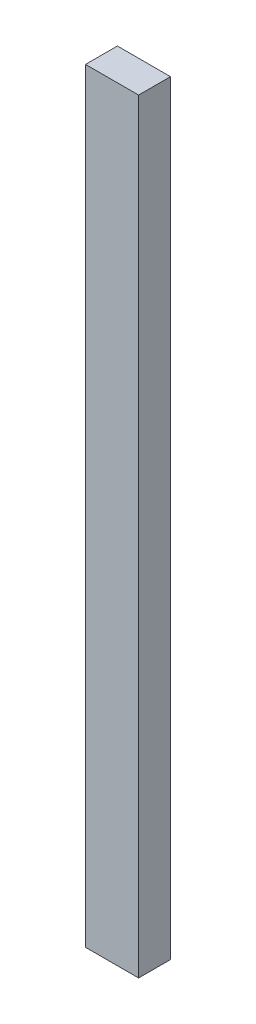
ISO-10303-21;
HEADER;
FILE_DESCRIPTION(('STEP AP214'),'2;1');
FILE_NAME('part.step','',(''),(''),'','','');
FILE_SCHEMA(('AUTOMOTIVE_DESIGN { 1 0 10303 214 1 1 1 1 }'));
ENDSEC;
DATA;
#1=APPLICATION_CONTEXT('core data for automotive mechanical design processes');
#2=APPLICATION_PROTOCOL_DEFINITION('international standard','automotive_design',2000,#1);
#3=PRODUCT_CONTEXT('',#1,'mechanical');
#4=PRODUCT('Part','Part','',(#3));
#5=PRODUCT_RELATED_PRODUCT_CATEGORY('part','',(#4));
#6=PRODUCT_DEFINITION_FORMATION('','',#4);
#7=PRODUCT_DEFINITION_CONTEXT('part definition',#1,'design');
#8=PRODUCT_DEFINITION('design','',#6,#7);
#9=PRODUCT_DEFINITION_SHAPE('','',#8);
#10=(LENGTH_UNIT() NAMED_UNIT(*) SI_UNIT(.MILLI.,.METRE.));
#11=(NAMED_UNIT(*) PLANE_ANGLE_UNIT() SI_UNIT($,.RADIAN.));
#12=(NAMED_UNIT(*) SI_UNIT($,.STERADIAN.) SOLID_ANGLE_UNIT());
#13=UNCERTAINTY_MEASURE_WITH_UNIT(LENGTH_MEASURE(1.E-05),#10,'distance_accuracy_value','');
#14=(GEOMETRIC_REPRESENTATION_CONTEXT(3) GLOBAL_UNCERTAINTY_ASSIGNED_CONTEXT((#13)) GLOBAL_UNIT_ASSIGNED_CONTEXT((#10,
#11,#12)) REPRESENTATION_CONTEXT('',''));
#15=CARTESIAN_POINT('',(0.,0.,0.));
#16=DIRECTION('',(0.,0.,1.));
#17=DIRECTION('',(1.,0.,0.));
#18=AXIS2_PLACEMENT_3D('',#15,#16,#17);
#19=CARTESIAN_POINT('',(31.75,914.4,19.05));
#20=DIRECTION('',(-1.,0.,0.));
#21=DIRECTION('',(0.,0.,1.));
#22=AXIS2_PLACEMENT_3D('',#19,#20,#21);
#23=PLANE('',#22);
#24=DIRECTION('',(0.,0.,-1.));
#25=VECTOR('',#24,1.);
#26=CARTESIAN_POINT('',(31.75,0.,19.05));
#27=LINE('',#26,#25);
#28=CARTESIAN_POINT('',(31.75,0.,19.05));
#29=VERTEX_POINT('',#28);
#30=CARTESIAN_POINT('',(31.75,0.,-19.05));
#31=VERTEX_POINT('',#30);
#32=EDGE_CURVE('E98',#29,#31,#27,.T.);
#33=ORIENTED_EDGE('',*,*,#32,.T.);
#34=DIRECTION('',(0.,-1.,0.));
#35=VECTOR('',#34,1.);
#36=CARTESIAN_POINT('',(31.75,914.4,-19.05));
#37=LINE('',#36,#35);
#38=CARTESIAN_POINT('',(31.75,914.4,-19.05));
#39=VERTEX_POINT('',#38);
#40=EDGE_CURVE('E11',#39,#31,#37,.T.);
#41=ORIENTED_EDGE('',*,*,#40,.F.);
#42=DIRECTION('',(0.,0.,-1.));
#43=VECTOR('',#42,1.);
#44=CARTESIAN_POINT('',(31.75,914.4,19.05));
#45=LINE('',#44,#43);
#46=CARTESIAN_POINT('',(31.75,914.4,19.05));
#47=VERTEX_POINT('',#46);
#48=EDGE_CURVE('E86',#47,#39,#45,.T.);
#49=ORIENTED_EDGE('',*,*,#48,.F.);
#50=DIRECTION('',(0.,-1.,0.));
#51=VECTOR('',#50,1.);
#52=CARTESIAN_POINT('',(31.75,914.4,19.05));
#53=LINE('',#52,#51);
#54=EDGE_CURVE('E94',#47,#29,#53,.T.);
#55=ORIENTED_EDGE('',*,*,#54,.T.);
#56=EDGE_LOOP('',(#33,#41,#49,#55));
#57=FACE_BOUND('',#56,.T.);
#58=ADVANCED_FACE('F35',(#57),#23,.F.);
#59=CARTESIAN_POINT('',(-31.75,914.4,-19.05));
#60=DIRECTION('',(0.,0.,1.));
#61=DIRECTION('',(1.,0.,0.));
#62=AXIS2_PLACEMENT_3D('',#59,#60,#61);
#63=PLANE('',#62);
#64=DIRECTION('',(-1.,0.,0.));
#65=VECTOR('',#64,1.);
#66=CARTESIAN_POINT('',(-31.75,0.,-19.05));
#67=LINE('',#66,#65);
#68=CARTESIAN_POINT('',(-31.75,0.,-19.05));
#69=VERTEX_POINT('',#68);
#70=EDGE_CURVE('E90',#31,#69,#67,.T.);
#71=ORIENTED_EDGE('',*,*,#70,.T.);
#72=DIRECTION('',(0.,-1.,0.));
#73=VECTOR('',#72,1.);
#74=CARTESIAN_POINT('',(-31.75,914.4,-19.05));
#75=LINE('',#74,#73);
#76=CARTESIAN_POINT('',(-31.75,914.4,-19.05));
#77=VERTEX_POINT('',#76);
#78=EDGE_CURVE('E43',#77,#69,#75,.T.);
#79=ORIENTED_EDGE('',*,*,#78,.F.);
#80=DIRECTION('',(-1.,0.,0.));
#81=VECTOR('',#80,1.);
#82=CARTESIAN_POINT('',(-31.75,914.4,-19.05));
#83=LINE('',#82,#81);
#84=EDGE_CURVE('E81',#39,#77,#83,.T.);
#85=ORIENTED_EDGE('',*,*,#84,.F.);
#86=ORIENTED_EDGE('',*,*,#40,.T.);
#87=EDGE_LOOP('',(#71,#79,#85,#86));
#88=FACE_BOUND('',#87,.T.);
#89=ADVANCED_FACE('F89',(#88),#63,.F.);
#90=CARTESIAN_POINT('',(-31.75,914.4,19.05));
#91=DIRECTION('',(1.,0.,0.));
#92=DIRECTION('',(0.,0.,-1.));
#93=AXIS2_PLACEMENT_3D('',#90,#91,#92);
#94=PLANE('',#93);
#95=DIRECTION('',(0.,0.,1.));
#96=VECTOR('',#95,1.);
#97=CARTESIAN_POINT('',(-31.75,0.,19.05));
#98=LINE('',#97,#96);
#99=CARTESIAN_POINT('',(-31.75,0.,19.05));
#100=VERTEX_POINT('',#99);
#101=EDGE_CURVE('E68',#69,#100,#98,.T.);
#102=ORIENTED_EDGE('',*,*,#101,.T.);
#103=DIRECTION('',(0.,-1.,0.));
#104=VECTOR('',#103,1.);
#105=CARTESIAN_POINT('',(-31.75,914.4,19.05));
#106=LINE('',#105,#104);
#107=CARTESIAN_POINT('',(-31.75,914.4,19.05));
#108=VERTEX_POINT('',#107);
#109=EDGE_CURVE('E91',#108,#100,#106,.T.);
#110=ORIENTED_EDGE('',*,*,#109,.F.);
#111=DIRECTION('',(0.,0.,1.));
#112=VECTOR('',#111,1.);
#113=CARTESIAN_POINT('',(-31.75,914.4,19.05));
#114=LINE('',#113,#112);
#115=EDGE_CURVE('E84',#77,#108,#114,.T.);
#116=ORIENTED_EDGE('',*,*,#115,.F.);
#117=ORIENTED_EDGE('',*,*,#78,.T.);
#118=EDGE_LOOP('',(#102,#110,#116,#117));
#119=FACE_BOUND('',#118,.T.);
#120=ADVANCED_FACE('F92',(#119),#94,.F.);
#121=CARTESIAN_POINT('',(-31.75,914.4,19.05));
#122=DIRECTION('',(0.,0.,-1.));
#123=DIRECTION('',(-1.,0.,0.));
#124=AXIS2_PLACEMENT_3D('',#121,#122,#123);
#125=PLANE('',#124);
#126=DIRECTION('',(1.,0.,0.));
#127=VECTOR('',#126,1.);
#128=CARTESIAN_POINT('',(-31.75,0.,19.05));
#129=LINE('',#128,#127);
#130=EDGE_CURVE('E74',#100,#29,#129,.T.);
#131=ORIENTED_EDGE('',*,*,#130,.T.);
#132=ORIENTED_EDGE('',*,*,#54,.F.);
#133=DIRECTION('',(1.,0.,0.));
#134=VECTOR('',#133,1.);
#135=CARTESIAN_POINT('',(-31.75,914.4,19.05));
#136=LINE('',#135,#134);
#137=EDGE_CURVE('E51',#108,#47,#136,.T.);
#138=ORIENTED_EDGE('',*,*,#137,.F.);
#139=ORIENTED_EDGE('',*,*,#109,.T.);
#140=EDGE_LOOP('',(#131,#132,#138,#139));
#141=FACE_BOUND('',#140,.T.);
#142=ADVANCED_FACE('F105',(#141),#125,.F.);
#143=CARTESIAN_POINT('',(0.,914.4,0.));
#144=DIRECTION('',(0.,-1.,0.));
#145=DIRECTION('',(0.,0.,-1.));
#146=AXIS2_PLACEMENT_3D('',#143,#144,#145);
#147=PLANE('',#146);
#148=ORIENTED_EDGE('',*,*,#48,.T.);
#149=ORIENTED_EDGE('',*,*,#84,.T.);
#150=ORIENTED_EDGE('',*,*,#115,.T.);
#151=ORIENTED_EDGE('',*,*,#137,.T.);
#152=EDGE_LOOP('',(#148,#149,#150,#151));
#153=FACE_BOUND('',#152,.T.);
#154=ADVANCED_FACE('F82',(#153),#147,.F.);
#155=CARTESIAN_POINT('',(0.,0.,0.));
#156=DIRECTION('',(0.,-1.,0.));
#157=DIRECTION('',(0.,0.,-1.));
#158=AXIS2_PLACEMENT_3D('',#155,#156,#157);
#159=PLANE('',#158);
#160=ORIENTED_EDGE('',*,*,#32,.F.);
#161=ORIENTED_EDGE('',*,*,#130,.F.);
#162=ORIENTED_EDGE('',*,*,#101,.F.);
#163=ORIENTED_EDGE('',*,*,#70,.F.);
#164=EDGE_LOOP('',(#160,#161,#162,#163));
#165=FACE_BOUND('',#164,.T.);
#166=ADVANCED_FACE('F108',(#165),#159,.T.);
#167=CLOSED_SHELL('',(#58,#89,#120,#142,#154,#166));
#168=MANIFOLD_SOLID_BREP('B2',#167);
#169=ADVANCED_BREP_SHAPE_REPRESENTATION('',(#18,#168),#14);
#170=SHAPE_DEFINITION_REPRESENTATION(#9,#169);
ENDSEC;
END-ISO-10303-21;
